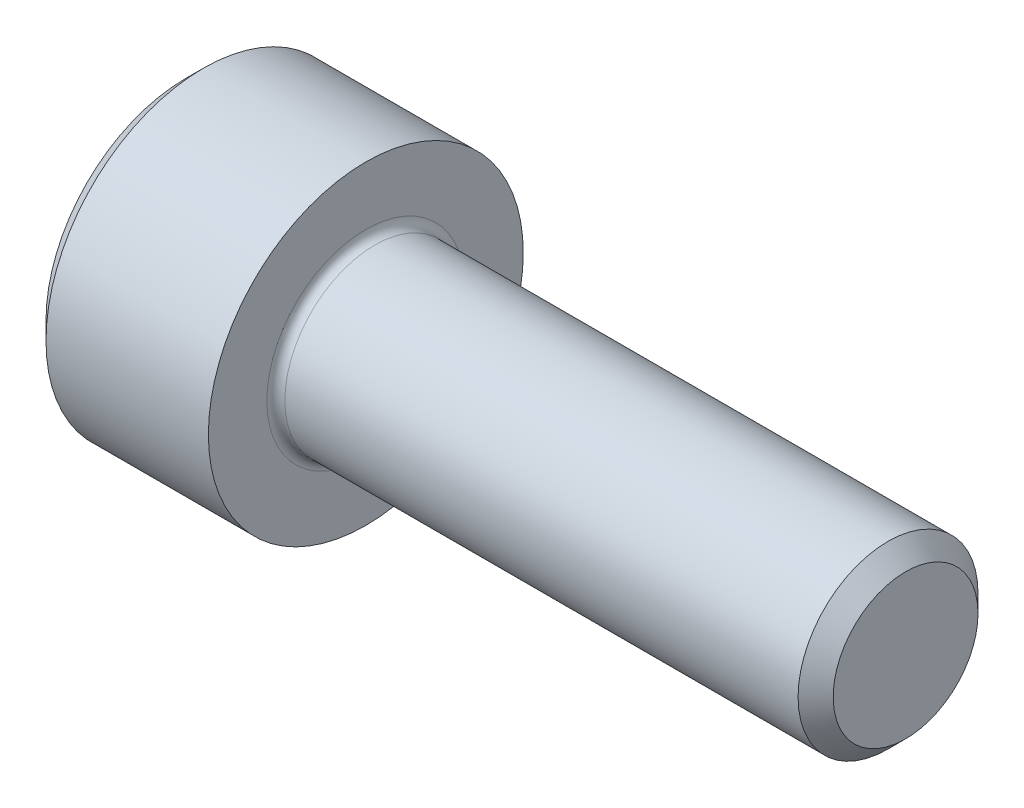
ISO-10303-21;
HEADER;
FILE_DESCRIPTION(('STEP AP214'),'2;1');
FILE_NAME('part.step','',(''),(''),'','','');
FILE_SCHEMA(('AUTOMOTIVE_DESIGN { 1 0 10303 214 1 1 1 1 }'));
ENDSEC;
DATA;
#1=APPLICATION_CONTEXT('core data for automotive mechanical design processes');
#2=APPLICATION_PROTOCOL_DEFINITION('international standard','automotive_design',2000,#1);
#3=PRODUCT_CONTEXT('',#1,'mechanical');
#4=PRODUCT('Part','Part','',(#3));
#5=PRODUCT_RELATED_PRODUCT_CATEGORY('part','',(#4));
#6=PRODUCT_DEFINITION_FORMATION('','',#4);
#7=PRODUCT_DEFINITION_CONTEXT('part definition',#1,'design');
#8=PRODUCT_DEFINITION('design','',#6,#7);
#9=PRODUCT_DEFINITION_SHAPE('','',#8);
#10=(LENGTH_UNIT() NAMED_UNIT(*) SI_UNIT(.MILLI.,.METRE.));
#11=(NAMED_UNIT(*) PLANE_ANGLE_UNIT() SI_UNIT($,.RADIAN.));
#12=(NAMED_UNIT(*) SI_UNIT($,.STERADIAN.) SOLID_ANGLE_UNIT());
#13=UNCERTAINTY_MEASURE_WITH_UNIT(LENGTH_MEASURE(1.E-05),#10,'distance_accuracy_value','');
#14=(GEOMETRIC_REPRESENTATION_CONTEXT(3) GLOBAL_UNCERTAINTY_ASSIGNED_CONTEXT((#13)) GLOBAL_UNIT_ASSIGNED_CONTEXT((#10,
#11,#12)) REPRESENTATION_CONTEXT('',''));
#15=CARTESIAN_POINT('',(0.,0.,0.));
#16=DIRECTION('',(0.,0.,1.));
#17=DIRECTION('',(1.,0.,0.));
#18=AXIS2_PLACEMENT_3D('',#15,#16,#17);
#19=CARTESIAN_POINT('',(2.,0.,0.));
#20=DIRECTION('',(-1.,0.,0.));
#21=DIRECTION('',(0.,0.,1.));
#22=AXIS2_PLACEMENT_3D('',#19,#20,#21);
#23=PLANE('',#22);
#24=DIRECTION('',(0.,0.5,-0.866025403784439));
#25=VECTOR('',#24,1.);
#26=CARTESIAN_POINT('',(2.,0.886521338340669,1.5355));
#27=LINE('',#26,#25);
#28=CARTESIAN_POINT('',(2.,0.886521338340669,1.5355));
#29=VERTEX_POINT('',#28);
#30=CARTESIAN_POINT('',(1.99999999995718,1.329782007511,0.767749999999998));
#31=VERTEX_POINT('',#30);
#32=EDGE_CURVE('E159',#29,#31,#27,.T.);
#33=ORIENTED_EDGE('',*,*,#32,.T.);
#34=CARTESIAN_POINT('',(1.99999999995718,0.,0.));
#35=DIRECTION('',(1.,0.,0.));
#36=DIRECTION('',(0.,1.,0.));
#37=AXIS2_PLACEMENT_3D('',#34,#35,#36);
#38=CIRCLE('',#37,1.53550000004801);
#39=CARTESIAN_POINT('',(1.99999999995718,0.,1.53550000004801));
#40=VERTEX_POINT('',#39);
#41=EDGE_CURVE('E47',#31,#40,#38,.T.);
#42=ORIENTED_EDGE('',*,*,#41,.T.);
#43=DIRECTION('',(0.,1.,0.));
#44=VECTOR('',#43,1.);
#45=CARTESIAN_POINT('',(2.,-0.886521338340673,1.5355));
#46=LINE('',#45,#44);
#47=EDGE_CURVE('E286',#40,#29,#46,.T.);
#48=ORIENTED_EDGE('',*,*,#47,.T.);
#49=EDGE_LOOP('',(#33,#42,#48));
#50=FACE_BOUND('',#49,.T.);
#51=ADVANCED_FACE('F32',(#50),#23,.T.);
#52=CARTESIAN_POINT('',(2.,-0.886521338340673,1.5355));
#53=VERTEX_POINT('',#52);
#54=EDGE_CURVE('E277',#53,#40,#46,.T.);
#55=ORIENTED_EDGE('',*,*,#54,.T.);
#56=CARTESIAN_POINT('',(1.99999999995718,-1.32978200755258,0.767750000024007));
#57=VERTEX_POINT('',#56);
#58=EDGE_CURVE('E204',#40,#57,#38,.T.);
#59=ORIENTED_EDGE('',*,*,#58,.T.);
#60=DIRECTION('',(0.,0.500000000000001,0.866025403784438));
#61=VECTOR('',#60,1.);
#62=CARTESIAN_POINT('',(2.,-1.77304267668135,0.));
#63=LINE('',#62,#61);
#64=EDGE_CURVE('E185',#57,#53,#63,.T.);
#65=ORIENTED_EDGE('',*,*,#64,.T.);
#66=EDGE_LOOP('',(#55,#59,#65));
#67=FACE_BOUND('',#66,.T.);
#68=ADVANCED_FACE('F122',(#67),#23,.T.);
#69=CARTESIAN_POINT('',(2.,-1.77304267668135,0.));
#70=VERTEX_POINT('',#69);
#71=EDGE_CURVE('E280',#70,#57,#63,.T.);
#72=ORIENTED_EDGE('',*,*,#71,.T.);
#73=CARTESIAN_POINT('',(1.99999999995718,-1.32978200755259,-0.767750000024006));
#74=VERTEX_POINT('',#73);
#75=EDGE_CURVE('E285',#57,#74,#38,.T.);
#76=ORIENTED_EDGE('',*,*,#75,.T.);
#77=DIRECTION('',(0.,-0.5,0.866025403784439));
#78=VECTOR('',#77,1.);
#79=CARTESIAN_POINT('',(2.,-0.886521338340675,-1.5355));
#80=LINE('',#79,#78);
#81=EDGE_CURVE('E164',#74,#70,#80,.T.);
#82=ORIENTED_EDGE('',*,*,#81,.T.);
#83=EDGE_LOOP('',(#72,#76,#82));
#84=FACE_BOUND('',#83,.T.);
#85=ADVANCED_FACE('F128',(#84),#23,.T.);
#86=CARTESIAN_POINT('',(2.,-0.886521338340675,-1.5355));
#87=VERTEX_POINT('',#86);
#88=EDGE_CURVE('E165',#87,#74,#80,.T.);
#89=ORIENTED_EDGE('',*,*,#88,.T.);
#90=CARTESIAN_POINT('',(1.99999999995718,0.,-1.53550000004801));
#91=VERTEX_POINT('',#90);
#92=EDGE_CURVE('E294',#74,#91,#38,.T.);
#93=ORIENTED_EDGE('',*,*,#92,.T.);
#94=DIRECTION('',(0.,-1.,0.));
#95=VECTOR('',#94,1.);
#96=CARTESIAN_POINT('',(2.,0.886521338340666,-1.5355));
#97=LINE('',#96,#95);
#98=EDGE_CURVE('E154',#91,#87,#97,.T.);
#99=ORIENTED_EDGE('',*,*,#98,.T.);
#100=EDGE_LOOP('',(#89,#93,#99));
#101=FACE_BOUND('',#100,.T.);
#102=ADVANCED_FACE('F143',(#101),#23,.T.);
#103=CARTESIAN_POINT('',(2.,0.886521338340666,-1.5355));
#104=VERTEX_POINT('',#103);
#105=EDGE_CURVE('E157',#104,#91,#97,.T.);
#106=ORIENTED_EDGE('',*,*,#105,.T.);
#107=CARTESIAN_POINT('',(1.99999999995718,1.32978200755258,-0.767750000024008));
#108=VERTEX_POINT('',#107);
#109=EDGE_CURVE('E292',#91,#108,#38,.T.);
#110=ORIENTED_EDGE('',*,*,#109,.T.);
#111=DIRECTION('',(0.,-0.500000000000001,-0.866025403784438));
#112=VECTOR('',#111,1.);
#113=CARTESIAN_POINT('',(2.,1.77304267668134,0.));
#114=LINE('',#113,#112);
#115=EDGE_CURVE('E155',#108,#104,#114,.T.);
#116=ORIENTED_EDGE('',*,*,#115,.T.);
#117=EDGE_LOOP('',(#106,#110,#116));
#118=FACE_BOUND('',#117,.T.);
#119=ADVANCED_FACE('F134',(#118),#23,.T.);
#120=CARTESIAN_POINT('',(2.,1.77304267668134,0.));
#121=VERTEX_POINT('',#120);
#122=EDGE_CURVE('E147',#121,#108,#114,.T.);
#123=ORIENTED_EDGE('',*,*,#122,.T.);
#124=EDGE_CURVE('E148',#108,#31,#38,.T.);
#125=ORIENTED_EDGE('',*,*,#124,.T.);
#126=EDGE_CURVE('E150',#31,#121,#27,.T.);
#127=ORIENTED_EDGE('',*,*,#126,.T.);
#128=EDGE_LOOP('',(#123,#125,#127));
#129=FACE_BOUND('',#128,.T.);
#130=ADVANCED_FACE('F124',(#129),#23,.T.);
#131=CARTESIAN_POINT('',(4.,3.5,0.));
#132=DIRECTION('',(1.,0.,0.));
#133=DIRECTION('',(0.,0.,-1.));
#134=AXIS2_PLACEMENT_3D('',#131,#132,#133);
#135=PLANE('',#134);
#136=CARTESIAN_POINT('',(4.,0.,0.));
#137=DIRECTION('',(1.,0.,0.));
#138=DIRECTION('',(0.,0.,-1.));
#139=AXIS2_PLACEMENT_3D('',#136,#137,#138);
#140=CIRCLE('',#139,2.19999999999999);
#141=CARTESIAN_POINT('',(4.,0.,-2.19999999999999));
#142=VERTEX_POINT('',#141);
#143=EDGE_CURVE('E11',#142,#142,#140,.F.);
#144=ORIENTED_EDGE('',*,*,#143,.T.);
#145=EDGE_LOOP('',(#144));
#146=FACE_BOUND('',#145,.T.);
#147=CARTESIAN_POINT('',(4.,0.,0.));
#148=DIRECTION('',(-1.,0.,0.));
#149=DIRECTION('',(0.,0.,1.));
#150=AXIS2_PLACEMENT_3D('',#147,#148,#149);
#151=CIRCLE('',#150,3.5);
#152=CARTESIAN_POINT('',(4.,0.,3.5));
#153=VERTEX_POINT('',#152);
#154=EDGE_CURVE('E188',#153,#153,#151,.T.);
#155=ORIENTED_EDGE('',*,*,#154,.F.);
#156=EDGE_LOOP('',(#155));
#157=FACE_BOUND('',#156,.T.);
#158=ADVANCED_FACE('F133',(#146,#157),#135,.T.);
#159=CARTESIAN_POINT('',(4.,0.,0.));
#160=DIRECTION('',(-1.,0.,0.));
#161=DIRECTION('',(0.,0.,1.));
#162=AXIS2_PLACEMENT_3D('',#159,#160,#161);
#163=CYLINDRICAL_SURFACE('',#162,3.5);
#164=CARTESIAN_POINT('',(0.389999999939001,0.,0.));
#165=DIRECTION('',(-1.,0.,0.));
#166=DIRECTION('',(0.,0.,1.));
#167=AXIS2_PLACEMENT_3D('',#164,#165,#166);
#168=CIRCLE('',#167,3.5);
#169=CARTESIAN_POINT('',(0.389999999939001,0.,3.5));
#170=VERTEX_POINT('',#169);
#171=EDGE_CURVE('E203',#170,#170,#168,.F.);
#172=ORIENTED_EDGE('',*,*,#171,.T.);
#173=EDGE_LOOP('',(#172));
#174=FACE_BOUND('',#173,.T.);
#175=ORIENTED_EDGE('',*,*,#154,.T.);
#176=EDGE_LOOP('',(#175));
#177=FACE_BOUND('',#176,.T.);
#178=ADVANCED_FACE('F140',(#174,#177),#163,.T.);
#179=CARTESIAN_POINT('',(0.,0.,0.));
#180=DIRECTION('',(-1.,0.,0.));
#181=DIRECTION('',(0.,0.,1.));
#182=AXIS2_PLACEMENT_3D('',#179,#180,#181);
#183=PLANE('',#182);
#184=CARTESIAN_POINT('',(0.,0.,0.));
#185=DIRECTION('',(-1.,0.,0.));
#186=DIRECTION('',(0.,0.,1.));
#187=AXIS2_PLACEMENT_3D('',#184,#185,#186);
#188=CIRCLE('',#187,3.11000000000416);
#189=CARTESIAN_POINT('',(0.,0.,3.11000000000416));
#190=VERTEX_POINT('',#189);
#191=EDGE_CURVE('E200',#190,#190,#188,.T.);
#192=ORIENTED_EDGE('',*,*,#191,.T.);
#193=EDGE_LOOP('',(#192));
#194=FACE_BOUND('',#193,.T.);
#195=DIRECTION('',(0.,0.500000000000001,0.866025403784438));
#196=VECTOR('',#195,1.);
#197=CARTESIAN_POINT('',(0.,-1.77304267668135,0.));
#198=LINE('',#197,#196);
#199=CARTESIAN_POINT('',(0.,-1.77304267668135,0.));
#200=VERTEX_POINT('',#199);
#201=CARTESIAN_POINT('',(0.,-0.886521338340673,1.5355));
#202=VERTEX_POINT('',#201);
#203=EDGE_CURVE('E55',#200,#202,#198,.T.);
#204=ORIENTED_EDGE('',*,*,#203,.F.);
#205=DIRECTION('',(0.,-0.5,0.866025403784439));
#206=VECTOR('',#205,1.);
#207=CARTESIAN_POINT('',(0.,-0.886521338340675,-1.5355));
#208=LINE('',#207,#206);
#209=CARTESIAN_POINT('',(0.,-0.886521338340675,-1.5355));
#210=VERTEX_POINT('',#209);
#211=EDGE_CURVE('E182',#210,#200,#208,.T.);
#212=ORIENTED_EDGE('',*,*,#211,.F.);
#213=DIRECTION('',(0.,-1.,0.));
#214=VECTOR('',#213,1.);
#215=CARTESIAN_POINT('',(0.,0.886521338340666,-1.5355));
#216=LINE('',#215,#214);
#217=CARTESIAN_POINT('',(0.,0.886521338340666,-1.5355));
#218=VERTEX_POINT('',#217);
#219=EDGE_CURVE('E179',#218,#210,#216,.T.);
#220=ORIENTED_EDGE('',*,*,#219,.F.);
#221=DIRECTION('',(0.,-0.500000000000001,-0.866025403784438));
#222=VECTOR('',#221,1.);
#223=CARTESIAN_POINT('',(0.,1.77304267668134,0.));
#224=LINE('',#223,#222);
#225=CARTESIAN_POINT('',(0.,1.77304267668134,0.));
#226=VERTEX_POINT('',#225);
#227=EDGE_CURVE('E176',#226,#218,#224,.T.);
#228=ORIENTED_EDGE('',*,*,#227,.F.);
#229=DIRECTION('',(0.,0.5,-0.866025403784439));
#230=VECTOR('',#229,1.);
#231=CARTESIAN_POINT('',(0.,0.886521338340669,1.5355));
#232=LINE('',#231,#230);
#233=CARTESIAN_POINT('',(0.,0.886521338340669,1.5355));
#234=VERTEX_POINT('',#233);
#235=EDGE_CURVE('E173',#234,#226,#232,.T.);
#236=ORIENTED_EDGE('',*,*,#235,.F.);
#237=DIRECTION('',(0.,1.,0.));
#238=VECTOR('',#237,1.);
#239=CARTESIAN_POINT('',(0.,-0.886521338340673,1.5355));
#240=LINE('',#239,#238);
#241=EDGE_CURVE('E170',#202,#234,#240,.T.);
#242=ORIENTED_EDGE('',*,*,#241,.F.);
#243=EDGE_LOOP('',(#204,#212,#220,#228,#236,#242));
#244=FACE_BOUND('',#243,.T.);
#245=ADVANCED_FACE('F229',(#194,#244),#183,.T.);
#246=CARTESIAN_POINT('',(16.,0.,0.));
#247=DIRECTION('',(-1.,0.,0.));
#248=DIRECTION('',(0.,0.,1.));
#249=AXIS2_PLACEMENT_3D('',#246,#247,#248);
#250=CYLINDRICAL_SURFACE('',#249,1.99999999999999);
#251=CARTESIAN_POINT('',(4.2,0.,0.));
#252=DIRECTION('',(1.,0.,0.));
#253=DIRECTION('',(0.,0.,-1.));
#254=AXIS2_PLACEMENT_3D('',#251,#252,#253);
#255=CIRCLE('',#254,1.99999999999999);
#256=CARTESIAN_POINT('',(4.2,0.,-1.99999999999999));
#257=VERTEX_POINT('',#256);
#258=EDGE_CURVE('E40',#257,#257,#255,.T.);
#259=ORIENTED_EDGE('',*,*,#258,.T.);
#260=EDGE_LOOP('',(#259));
#261=FACE_BOUND('',#260,.T.);
#262=CARTESIAN_POINT('',(15.610000000061,0.,0.));
#263=DIRECTION('',(1.,0.,0.));
#264=DIRECTION('',(0.,0.,-1.));
#265=AXIS2_PLACEMENT_3D('',#262,#263,#264);
#266=CIRCLE('',#265,1.99999999999999);
#267=CARTESIAN_POINT('',(15.610000000061,0.,-1.99999999999999));
#268=VERTEX_POINT('',#267);
#269=EDGE_CURVE('E210',#268,#268,#266,.F.);
#270=ORIENTED_EDGE('',*,*,#269,.T.);
#271=EDGE_LOOP('',(#270));
#272=FACE_BOUND('',#271,.T.);
#273=ADVANCED_FACE('F215',(#261,#272),#250,.T.);
#274=CARTESIAN_POINT('',(16.,0.,0.));
#275=DIRECTION('',(1.,0.,0.));
#276=DIRECTION('',(0.,0.,-1.));
#277=AXIS2_PLACEMENT_3D('',#274,#275,#276);
#278=PLANE('',#277);
#279=CARTESIAN_POINT('',(16.,0.,0.));
#280=DIRECTION('',(1.,0.,0.));
#281=DIRECTION('',(0.,0.,-1.));
#282=AXIS2_PLACEMENT_3D('',#279,#280,#281);
#283=CIRCLE('',#282,1.61000000000415);
#284=CARTESIAN_POINT('',(16.,0.,-1.61000000000415));
#285=VERTEX_POINT('',#284);
#286=EDGE_CURVE('E207',#285,#285,#283,.T.);
#287=ORIENTED_EDGE('',*,*,#286,.T.);
#288=EDGE_LOOP('',(#287));
#289=FACE_BOUND('',#288,.T.);
#290=ADVANCED_FACE('F240',(#289),#278,.T.);
#291=CARTESIAN_POINT('',(2.,-1.77304267668135,0.));
#292=DIRECTION('',(0.,-0.866025403784438,0.500000000000001));
#293=DIRECTION('',(0.,-0.500000000000001,-0.866025403784438));
#294=AXIS2_PLACEMENT_3D('',#291,#292,#293);
#295=PLANE('',#294);
#296=ORIENTED_EDGE('',*,*,#203,.T.);
#297=DIRECTION('',(-1.,0.,0.));
#298=VECTOR('',#297,1.);
#299=CARTESIAN_POINT('',(2.,-0.886521338340673,1.5355));
#300=LINE('',#299,#298);
#301=EDGE_CURVE('E168',#53,#202,#300,.T.);
#302=ORIENTED_EDGE('',*,*,#301,.F.);
#303=ORIENTED_EDGE('',*,*,#64,.F.);
#304=ORIENTED_EDGE('',*,*,#71,.F.);
#305=DIRECTION('',(-1.,0.,0.));
#306=VECTOR('',#305,1.);
#307=CARTESIAN_POINT('',(2.,-1.77304267668135,0.));
#308=LINE('',#307,#306);
#309=EDGE_CURVE('E186',#70,#200,#308,.T.);
#310=ORIENTED_EDGE('',*,*,#309,.T.);
#311=EDGE_LOOP('',(#296,#302,#303,#304,#310));
#312=FACE_BOUND('',#311,.T.);
#313=ADVANCED_FACE('F243',(#312),#295,.F.);
#314=CARTESIAN_POINT('',(2.,-0.886521338340675,-1.5355));
#315=DIRECTION('',(0.,-0.866025403784439,-0.5));
#316=DIRECTION('',(0.,0.5,-0.866025403784439));
#317=AXIS2_PLACEMENT_3D('',#314,#315,#316);
#318=PLANE('',#317);
#319=ORIENTED_EDGE('',*,*,#211,.T.);
#320=ORIENTED_EDGE('',*,*,#309,.F.);
#321=ORIENTED_EDGE('',*,*,#81,.F.);
#322=ORIENTED_EDGE('',*,*,#88,.F.);
#323=DIRECTION('',(-1.,0.,0.));
#324=VECTOR('',#323,1.);
#325=CARTESIAN_POINT('',(2.,-0.886521338340675,-1.5355));
#326=LINE('',#325,#324);
#327=EDGE_CURVE('E189',#87,#210,#326,.T.);
#328=ORIENTED_EDGE('',*,*,#327,.T.);
#329=EDGE_LOOP('',(#319,#320,#321,#322,#328));
#330=FACE_BOUND('',#329,.T.);
#331=ADVANCED_FACE('F246',(#330),#318,.F.);
#332=CARTESIAN_POINT('',(2.,0.886521338340666,-1.5355));
#333=DIRECTION('',(0.,0.,-1.));
#334=DIRECTION('',(0.,1.,0.));
#335=AXIS2_PLACEMENT_3D('',#332,#333,#334);
#336=PLANE('',#335);
#337=ORIENTED_EDGE('',*,*,#219,.T.);
#338=ORIENTED_EDGE('',*,*,#327,.F.);
#339=ORIENTED_EDGE('',*,*,#98,.F.);
#340=ORIENTED_EDGE('',*,*,#105,.F.);
#341=DIRECTION('',(-1.,0.,0.));
#342=VECTOR('',#341,1.);
#343=CARTESIAN_POINT('',(2.,0.886521338340666,-1.5355));
#344=LINE('',#343,#342);
#345=EDGE_CURVE('E191',#104,#218,#344,.T.);
#346=ORIENTED_EDGE('',*,*,#345,.T.);
#347=EDGE_LOOP('',(#337,#338,#339,#340,#346));
#348=FACE_BOUND('',#347,.T.);
#349=ADVANCED_FACE('F254',(#348),#336,.F.);
#350=CARTESIAN_POINT('',(2.,1.77304267668134,0.));
#351=DIRECTION('',(0.,0.866025403784438,-0.500000000000001));
#352=DIRECTION('',(0.,0.500000000000001,0.866025403784438));
#353=AXIS2_PLACEMENT_3D('',#350,#351,#352);
#354=PLANE('',#353);
#355=ORIENTED_EDGE('',*,*,#227,.T.);
#356=ORIENTED_EDGE('',*,*,#345,.F.);
#357=ORIENTED_EDGE('',*,*,#115,.F.);
#358=ORIENTED_EDGE('',*,*,#122,.F.);
#359=DIRECTION('',(-1.,0.,0.));
#360=VECTOR('',#359,1.);
#361=CARTESIAN_POINT('',(2.,1.77304267668134,0.));
#362=LINE('',#361,#360);
#363=EDGE_CURVE('E193',#121,#226,#362,.T.);
#364=ORIENTED_EDGE('',*,*,#363,.T.);
#365=EDGE_LOOP('',(#355,#356,#357,#358,#364));
#366=FACE_BOUND('',#365,.T.);
#367=ADVANCED_FACE('F250',(#366),#354,.F.);
#368=CARTESIAN_POINT('',(2.,0.886521338340669,1.5355));
#369=DIRECTION('',(0.,0.866025403784439,0.5));
#370=DIRECTION('',(0.,-0.5,0.866025403784439));
#371=AXIS2_PLACEMENT_3D('',#368,#369,#370);
#372=PLANE('',#371);
#373=ORIENTED_EDGE('',*,*,#235,.T.);
#374=ORIENTED_EDGE('',*,*,#363,.F.);
#375=ORIENTED_EDGE('',*,*,#126,.F.);
#376=ORIENTED_EDGE('',*,*,#32,.F.);
#377=DIRECTION('',(-1.,0.,0.));
#378=VECTOR('',#377,1.);
#379=CARTESIAN_POINT('',(2.,0.886521338340669,1.5355));
#380=LINE('',#379,#378);
#381=EDGE_CURVE('E195',#29,#234,#380,.T.);
#382=ORIENTED_EDGE('',*,*,#381,.T.);
#383=EDGE_LOOP('',(#373,#374,#375,#376,#382));
#384=FACE_BOUND('',#383,.T.);
#385=ADVANCED_FACE('F117',(#384),#372,.F.);
#386=CARTESIAN_POINT('',(2.,-0.886521338340673,1.5355));
#387=DIRECTION('',(0.,0.,1.));
#388=DIRECTION('',(0.,-1.,0.));
#389=AXIS2_PLACEMENT_3D('',#386,#387,#388);
#390=PLANE('',#389);
#391=ORIENTED_EDGE('',*,*,#241,.T.);
#392=ORIENTED_EDGE('',*,*,#381,.F.);
#393=ORIENTED_EDGE('',*,*,#47,.F.);
#394=ORIENTED_EDGE('',*,*,#54,.F.);
#395=ORIENTED_EDGE('',*,*,#301,.T.);
#396=EDGE_LOOP('',(#391,#392,#393,#394,#395));
#397=FACE_BOUND('',#396,.T.);
#398=ADVANCED_FACE('F108',(#397),#390,.F.);
#399=CARTESIAN_POINT('',(2.88652133832557,0.,0.));
#400=DIRECTION('',(-1.,0.,0.));
#401=DIRECTION('',(0.,-1.,0.));
#402=AXIS2_PLACEMENT_3D('',#399,#400,#401);
#403=CONICAL_SURFACE('',#402,0.,1.0471975511966);
#404=ORIENTED_EDGE('',*,*,#41,.F.);
#405=ORIENTED_EDGE('',*,*,#124,.F.);
#406=ORIENTED_EDGE('',*,*,#109,.F.);
#407=ORIENTED_EDGE('',*,*,#92,.F.);
#408=ORIENTED_EDGE('',*,*,#75,.F.);
#409=ORIENTED_EDGE('',*,*,#58,.F.);
#410=EDGE_LOOP('',(#404,#405,#406,#407,#408,#409));
#411=FACE_BOUND('',#410,.T.);
#412=CARTESIAN_POINT('',(2.88652133832557,0.,0.));
#413=VERTEX_POINT('',#412);
#414=VERTEX_LOOP('',#413);
#415=FACE_BOUND('',#414,.T.);
#416=ADVANCED_FACE('F105',(#411,#415),#403,.F.);
#417=CARTESIAN_POINT('',(0.,0.,0.));
#418=DIRECTION('',(1.,0.,0.));
#419=DIRECTION('',(0.,0.,-1.));
#420=AXIS2_PLACEMENT_3D('',#417,#418,#419);
#421=CONICAL_SURFACE('',#420,3.11000000000416,0.785398163470321);
#422=ORIENTED_EDGE('',*,*,#171,.F.);
#423=EDGE_LOOP('',(#422));
#424=FACE_BOUND('',#423,.T.);
#425=ORIENTED_EDGE('',*,*,#191,.F.);
#426=EDGE_LOOP('',(#425));
#427=FACE_BOUND('',#426,.T.);
#428=ADVANCED_FACE('F107',(#424,#427),#421,.T.);
#429=CARTESIAN_POINT('',(16.,0.,0.));
#430=DIRECTION('',(-1.,0.,0.));
#431=DIRECTION('',(0.,0.,1.));
#432=AXIS2_PLACEMENT_3D('',#429,#430,#431);
#433=CONICAL_SURFACE('',#432,1.61000000000415,0.785398163470323);
#434=ORIENTED_EDGE('',*,*,#269,.F.);
#435=EDGE_LOOP('',(#434));
#436=FACE_BOUND('',#435,.T.);
#437=ORIENTED_EDGE('',*,*,#286,.F.);
#438=EDGE_LOOP('',(#437));
#439=FACE_BOUND('',#438,.T.);
#440=ADVANCED_FACE('F114',(#436,#439),#433,.T.);
#441=CARTESIAN_POINT('',(4.2,0.,0.));
#442=DIRECTION('',(1.,0.,0.));
#443=DIRECTION('',(0.,0.,-1.));
#444=AXIS2_PLACEMENT_3D('',#441,#442,#443);
#445=TOROIDAL_SURFACE('',#444,2.19999999999999,0.2);
#446=ORIENTED_EDGE('',*,*,#143,.F.);
#447=EDGE_LOOP('',(#446));
#448=FACE_BOUND('',#447,.T.);
#449=ORIENTED_EDGE('',*,*,#258,.F.);
#450=EDGE_LOOP('',(#449));
#451=FACE_BOUND('',#450,.T.);
#452=ADVANCED_FACE('F34',(#448,#451),#445,.F.);
#453=CLOSED_SHELL('',(#51,#68,#85,#102,#119,#130,#158,#178,#245,#273,#290,#313,#331,#349,#367,
#385,#398,#416,#428,#440,#452));
#454=MANIFOLD_SOLID_BREP('B2',#453);
#455=ADVANCED_BREP_SHAPE_REPRESENTATION('',(#18,#454),#14);
#456=SHAPE_DEFINITION_REPRESENTATION(#9,#455);
ENDSEC;
END-ISO-10303-21;
